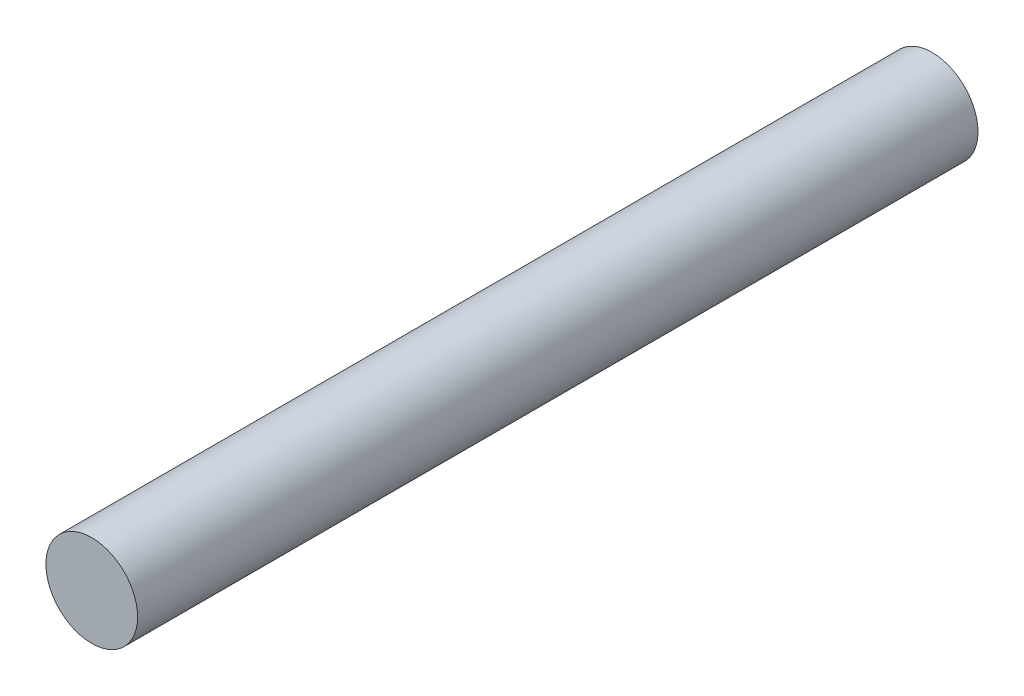
ISO-10303-21;
HEADER;
FILE_DESCRIPTION(('STEP AP214'),'2;1');
FILE_NAME('part.step','',(''),(''),'','','');
FILE_SCHEMA(('AUTOMOTIVE_DESIGN { 1 0 10303 214 1 1 1 1 }'));
ENDSEC;
DATA;
#1=APPLICATION_CONTEXT('core data for automotive mechanical design processes');
#2=APPLICATION_PROTOCOL_DEFINITION('international standard','automotive_design',2000,#1);
#3=PRODUCT_CONTEXT('',#1,'mechanical');
#4=PRODUCT('Part','Part','',(#3));
#5=PRODUCT_RELATED_PRODUCT_CATEGORY('part','',(#4));
#6=PRODUCT_DEFINITION_FORMATION('','',#4);
#7=PRODUCT_DEFINITION_CONTEXT('part definition',#1,'design');
#8=PRODUCT_DEFINITION('design','',#6,#7);
#9=PRODUCT_DEFINITION_SHAPE('','',#8);
#10=(LENGTH_UNIT() NAMED_UNIT(*) SI_UNIT(.MILLI.,.METRE.));
#11=(NAMED_UNIT(*) PLANE_ANGLE_UNIT() SI_UNIT($,.RADIAN.));
#12=(NAMED_UNIT(*) SI_UNIT($,.STERADIAN.) SOLID_ANGLE_UNIT());
#13=UNCERTAINTY_MEASURE_WITH_UNIT(LENGTH_MEASURE(1.E-05),#10,'distance_accuracy_value','');
#14=(GEOMETRIC_REPRESENTATION_CONTEXT(3) GLOBAL_UNCERTAINTY_ASSIGNED_CONTEXT((#13)) GLOBAL_UNIT_ASSIGNED_CONTEXT((#10,
#11,#12)) REPRESENTATION_CONTEXT('',''));
#15=CARTESIAN_POINT('',(0.,0.,0.));
#16=DIRECTION('',(0.,0.,1.));
#17=DIRECTION('',(1.,0.,0.));
#18=AXIS2_PLACEMENT_3D('',#15,#16,#17);
#19=CARTESIAN_POINT('',(0.,0.,55.));
#20=DIRECTION('',(0.,0.,-1.));
#21=DIRECTION('',(-1.,0.,0.));
#22=AXIS2_PLACEMENT_3D('',#19,#20,#21);
#23=CYLINDRICAL_SURFACE('',#22,3.);
#24=CARTESIAN_POINT('',(0.,0.,55.));
#25=DIRECTION('',(0.,0.,1.));
#26=DIRECTION('',(1.,0.,0.));
#27=AXIS2_PLACEMENT_3D('',#24,#25,#26);
#28=CIRCLE('',#27,3.);
#29=CARTESIAN_POINT('',(3.,0.,55.));
#30=VERTEX_POINT('',#29);
#31=EDGE_CURVE('E10',#30,#30,#28,.T.);
#32=ORIENTED_EDGE('',*,*,#31,.F.);
#33=EDGE_LOOP('',(#32));
#34=FACE_BOUND('',#33,.T.);
#35=CARTESIAN_POINT('',(0.,0.,0.));
#36=DIRECTION('',(0.,0.,1.));
#37=DIRECTION('',(1.,0.,0.));
#38=AXIS2_PLACEMENT_3D('',#35,#36,#37);
#39=CIRCLE('',#38,3.);
#40=CARTESIAN_POINT('',(3.,0.,0.));
#41=VERTEX_POINT('',#40);
#42=EDGE_CURVE('E33',#41,#41,#39,.T.);
#43=ORIENTED_EDGE('',*,*,#42,.T.);
#44=EDGE_LOOP('',(#43));
#45=FACE_BOUND('',#44,.T.);
#46=ADVANCED_FACE('F30',(#34,#45),#23,.T.);
#47=CARTESIAN_POINT('',(0.,0.,55.));
#48=DIRECTION('',(0.,0.,1.));
#49=DIRECTION('',(1.,0.,0.));
#50=AXIS2_PLACEMENT_3D('',#47,#48,#49);
#51=PLANE('',#50);
#52=ORIENTED_EDGE('',*,*,#31,.T.);
#53=EDGE_LOOP('',(#52));
#54=FACE_BOUND('',#53,.T.);
#55=ADVANCED_FACE('F45',(#54),#51,.T.);
#56=CARTESIAN_POINT('',(0.,0.,0.));
#57=DIRECTION('',(0.,0.,1.));
#58=DIRECTION('',(1.,0.,0.));
#59=AXIS2_PLACEMENT_3D('',#56,#57,#58);
#60=PLANE('',#59);
#61=ORIENTED_EDGE('',*,*,#42,.F.);
#62=EDGE_LOOP('',(#61));
#63=FACE_BOUND('',#62,.T.);
#64=ADVANCED_FACE('F43',(#63),#60,.F.);
#65=CLOSED_SHELL('',(#46,#55,#64));
#66=MANIFOLD_SOLID_BREP('B2',#65);
#67=ADVANCED_BREP_SHAPE_REPRESENTATION('',(#18,#66),#14);
#68=SHAPE_DEFINITION_REPRESENTATION(#9,#67);
ENDSEC;
END-ISO-10303-21;
